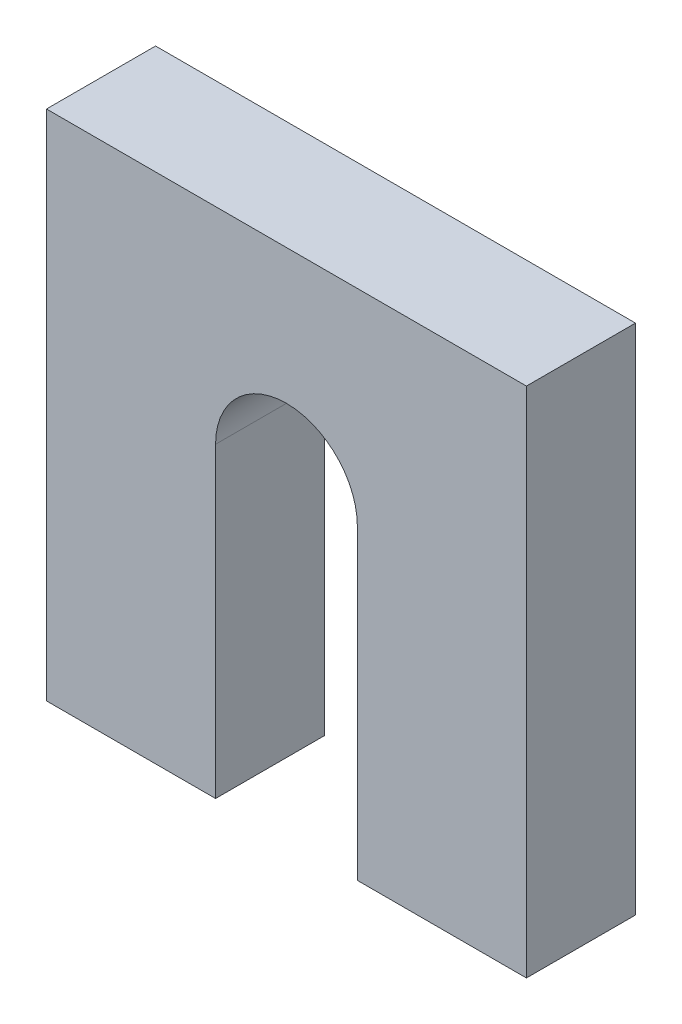
ISO-10303-21;
HEADER;
FILE_DESCRIPTION(('STEP AP214'),'2;1');
FILE_NAME('part.step','',(''),(''),'','','');
FILE_SCHEMA(('AUTOMOTIVE_DESIGN { 1 0 10303 214 1 1 1 1 }'));
ENDSEC;
DATA;
#1=APPLICATION_CONTEXT('core data for automotive mechanical design processes');
#2=APPLICATION_PROTOCOL_DEFINITION('international standard','automotive_design',2000,#1);
#3=PRODUCT_CONTEXT('',#1,'mechanical');
#4=PRODUCT('Part','Part','',(#3));
#5=PRODUCT_RELATED_PRODUCT_CATEGORY('part','',(#4));
#6=PRODUCT_DEFINITION_FORMATION('','',#4);
#7=PRODUCT_DEFINITION_CONTEXT('part definition',#1,'design');
#8=PRODUCT_DEFINITION('design','',#6,#7);
#9=PRODUCT_DEFINITION_SHAPE('','',#8);
#10=(LENGTH_UNIT() NAMED_UNIT(*) SI_UNIT(.MILLI.,.METRE.));
#11=(NAMED_UNIT(*) PLANE_ANGLE_UNIT() SI_UNIT($,.RADIAN.));
#12=(NAMED_UNIT(*) SI_UNIT($,.STERADIAN.) SOLID_ANGLE_UNIT());
#13=UNCERTAINTY_MEASURE_WITH_UNIT(LENGTH_MEASURE(1.E-05),#10,'distance_accuracy_value','');
#14=(GEOMETRIC_REPRESENTATION_CONTEXT(3) GLOBAL_UNCERTAINTY_ASSIGNED_CONTEXT((#13)) GLOBAL_UNIT_ASSIGNED_CONTEXT((#10,
#11,#12)) REPRESENTATION_CONTEXT('',''));
#15=CARTESIAN_POINT('',(0.,0.,0.));
#16=DIRECTION('',(0.,0.,1.));
#17=DIRECTION('',(1.,0.,0.));
#18=AXIS2_PLACEMENT_3D('',#15,#16,#17);
#19=CARTESIAN_POINT('',(22.,-23.5,10.));
#20=DIRECTION('',(0.,1.,0.));
#21=DIRECTION('',(-1.,0.,0.));
#22=AXIS2_PLACEMENT_3D('',#19,#20,#21);
#23=PLANE('',#22);
#24=DIRECTION('',(1.,0.,0.));
#25=VECTOR('',#24,1.);
#26=CARTESIAN_POINT('',(22.,-23.5,0.));
#27=LINE('',#26,#25);
#28=CARTESIAN_POINT('',(-22.,-23.5,0.));
#29=VERTEX_POINT('',#28);
#30=CARTESIAN_POINT('',(-6.5,-23.5,0.));
#31=VERTEX_POINT('',#30);
#32=EDGE_CURVE('E145',#29,#31,#27,.T.);
#33=ORIENTED_EDGE('',*,*,#32,.T.);
#34=DIRECTION('',(0.,0.,1.));
#35=VECTOR('',#34,1.);
#36=CARTESIAN_POINT('',(-6.5,-23.5,0.));
#37=LINE('',#36,#35);
#38=CARTESIAN_POINT('',(-6.5,-23.5,10.));
#39=VERTEX_POINT('',#38);
#40=EDGE_CURVE('E152',#31,#39,#37,.T.);
#41=ORIENTED_EDGE('',*,*,#40,.T.);
#42=DIRECTION('',(1.,0.,0.));
#43=VECTOR('',#42,1.);
#44=CARTESIAN_POINT('',(22.,-23.5,10.));
#45=LINE('',#44,#43);
#46=CARTESIAN_POINT('',(-22.,-23.5,10.));
#47=VERTEX_POINT('',#46);
#48=EDGE_CURVE('E96',#47,#39,#45,.T.);
#49=ORIENTED_EDGE('',*,*,#48,.F.);
#50=DIRECTION('',(0.,0.,-1.));
#51=VECTOR('',#50,1.);
#52=CARTESIAN_POINT('',(-22.,-23.5,10.));
#53=LINE('',#52,#51);
#54=EDGE_CURVE('E11',#47,#29,#53,.T.);
#55=ORIENTED_EDGE('',*,*,#54,.T.);
#56=EDGE_LOOP('',(#33,#41,#49,#55));
#57=FACE_BOUND('',#56,.T.);
#58=ADVANCED_FACE('F43',(#57),#23,.F.);
#59=CARTESIAN_POINT('',(-22.,23.5,10.));
#60=DIRECTION('',(1.,0.,0.));
#61=DIRECTION('',(0.,1.,0.));
#62=AXIS2_PLACEMENT_3D('',#59,#60,#61);
#63=PLANE('',#62);
#64=DIRECTION('',(0.,-1.,0.));
#65=VECTOR('',#64,1.);
#66=CARTESIAN_POINT('',(-22.,23.5,0.));
#67=LINE('',#66,#65);
#68=CARTESIAN_POINT('',(-22.,23.5,0.));
#69=VERTEX_POINT('',#68);
#70=EDGE_CURVE('E146',#69,#29,#67,.T.);
#71=ORIENTED_EDGE('',*,*,#70,.T.);
#72=ORIENTED_EDGE('',*,*,#54,.F.);
#73=DIRECTION('',(0.,-1.,0.));
#74=VECTOR('',#73,1.);
#75=CARTESIAN_POINT('',(-22.,23.5,10.));
#76=LINE('',#75,#74);
#77=CARTESIAN_POINT('',(-22.,23.5,10.));
#78=VERTEX_POINT('',#77);
#79=EDGE_CURVE('E160',#78,#47,#76,.T.);
#80=ORIENTED_EDGE('',*,*,#79,.F.);
#81=DIRECTION('',(0.,0.,-1.));
#82=VECTOR('',#81,1.);
#83=CARTESIAN_POINT('',(-22.,23.5,10.));
#84=LINE('',#83,#82);
#85=EDGE_CURVE('E161',#78,#69,#84,.T.);
#86=ORIENTED_EDGE('',*,*,#85,.T.);
#87=EDGE_LOOP('',(#71,#72,#80,#86));
#88=FACE_BOUND('',#87,.T.);
#89=ADVANCED_FACE('F45',(#88),#63,.F.);
#90=CARTESIAN_POINT('',(6.5,-23.5,10.));
#91=VERTEX_POINT('',#90);
#92=CARTESIAN_POINT('',(22.,-23.5,10.));
#93=VERTEX_POINT('',#92);
#94=EDGE_CURVE('E136',#91,#93,#45,.T.);
#95=ORIENTED_EDGE('',*,*,#94,.F.);
#96=DIRECTION('',(0.,0.,1.));
#97=VECTOR('',#96,1.);
#98=CARTESIAN_POINT('',(6.5,-23.5,0.));
#99=LINE('',#98,#97);
#100=CARTESIAN_POINT('',(6.5,-23.5,0.));
#101=VERTEX_POINT('',#100);
#102=EDGE_CURVE('E122',#101,#91,#99,.T.);
#103=ORIENTED_EDGE('',*,*,#102,.F.);
#104=CARTESIAN_POINT('',(22.,-23.5,0.));
#105=VERTEX_POINT('',#104);
#106=EDGE_CURVE('E134',#101,#105,#27,.T.);
#107=ORIENTED_EDGE('',*,*,#106,.T.);
#108=DIRECTION('',(0.,0.,-1.));
#109=VECTOR('',#108,1.);
#110=CARTESIAN_POINT('',(22.,-23.5,10.));
#111=LINE('',#110,#109);
#112=EDGE_CURVE('E52',#93,#105,#111,.T.);
#113=ORIENTED_EDGE('',*,*,#112,.F.);
#114=EDGE_LOOP('',(#95,#103,#107,#113));
#115=FACE_BOUND('',#114,.T.);
#116=ADVANCED_FACE('F132',(#115),#23,.F.);
#117=CARTESIAN_POINT('',(22.,23.5,10.));
#118=DIRECTION('',(-1.,0.,0.));
#119=DIRECTION('',(0.,-1.,0.));
#120=AXIS2_PLACEMENT_3D('',#117,#118,#119);
#121=PLANE('',#120);
#122=DIRECTION('',(0.,1.,0.));
#123=VECTOR('',#122,1.);
#124=CARTESIAN_POINT('',(22.,23.5,0.));
#125=LINE('',#124,#123);
#126=CARTESIAN_POINT('',(22.,23.5,0.));
#127=VERTEX_POINT('',#126);
#128=EDGE_CURVE('E143',#105,#127,#125,.T.);
#129=ORIENTED_EDGE('',*,*,#128,.T.);
#130=DIRECTION('',(0.,0.,-1.));
#131=VECTOR('',#130,1.);
#132=CARTESIAN_POINT('',(22.,23.5,10.));
#133=LINE('',#132,#131);
#134=CARTESIAN_POINT('',(22.,23.5,10.));
#135=VERTEX_POINT('',#134);
#136=EDGE_CURVE('E164',#135,#127,#133,.T.);
#137=ORIENTED_EDGE('',*,*,#136,.F.);
#138=DIRECTION('',(0.,1.,0.));
#139=VECTOR('',#138,1.);
#140=CARTESIAN_POINT('',(22.,23.5,10.));
#141=LINE('',#140,#139);
#142=EDGE_CURVE('E171',#93,#135,#141,.T.);
#143=ORIENTED_EDGE('',*,*,#142,.F.);
#144=ORIENTED_EDGE('',*,*,#112,.T.);
#145=EDGE_LOOP('',(#129,#137,#143,#144));
#146=FACE_BOUND('',#145,.T.);
#147=ADVANCED_FACE('F169',(#146),#121,.F.);
#148=CARTESIAN_POINT('',(22.,23.5,10.));
#149=DIRECTION('',(0.,-1.,0.));
#150=DIRECTION('',(1.,0.,0.));
#151=AXIS2_PLACEMENT_3D('',#148,#149,#150);
#152=PLANE('',#151);
#153=DIRECTION('',(-1.,0.,0.));
#154=VECTOR('',#153,1.);
#155=CARTESIAN_POINT('',(22.,23.5,0.));
#156=LINE('',#155,#154);
#157=EDGE_CURVE('E89',#127,#69,#156,.T.);
#158=ORIENTED_EDGE('',*,*,#157,.T.);
#159=ORIENTED_EDGE('',*,*,#85,.F.);
#160=DIRECTION('',(-1.,0.,0.));
#161=VECTOR('',#160,1.);
#162=CARTESIAN_POINT('',(22.,23.5,10.));
#163=LINE('',#162,#161);
#164=EDGE_CURVE('E68',#135,#78,#163,.T.);
#165=ORIENTED_EDGE('',*,*,#164,.F.);
#166=ORIENTED_EDGE('',*,*,#136,.T.);
#167=EDGE_LOOP('',(#158,#159,#165,#166));
#168=FACE_BOUND('',#167,.T.);
#169=ADVANCED_FACE('F205',(#168),#152,.F.);
#170=CARTESIAN_POINT('',(0.,0.,10.));
#171=DIRECTION('',(0.,0.,-1.));
#172=DIRECTION('',(-1.,0.,0.));
#173=AXIS2_PLACEMENT_3D('',#170,#171,#172);
#174=PLANE('',#173);
#175=ORIENTED_EDGE('',*,*,#48,.T.);
#176=DIRECTION('',(0.,-1.,0.));
#177=VECTOR('',#176,1.);
#178=CARTESIAN_POINT('',(-6.5,-23.5,10.));
#179=LINE('',#178,#177);
#180=CARTESIAN_POINT('',(-6.5,4.62828051725641,10.));
#181=VERTEX_POINT('',#180);
#182=EDGE_CURVE('E128',#181,#39,#179,.T.);
#183=ORIENTED_EDGE('',*,*,#182,.F.);
#184=CARTESIAN_POINT('',(0.,4.62828051725641,10.));
#185=DIRECTION('',(0.,0.,1.));
#186=DIRECTION('',(1.,0.,0.));
#187=AXIS2_PLACEMENT_3D('',#184,#185,#186);
#188=CIRCLE('',#187,6.5);
#189=CARTESIAN_POINT('',(6.5,4.62828051725641,10.));
#190=VERTEX_POINT('',#189);
#191=EDGE_CURVE('E189',#190,#181,#188,.T.);
#192=ORIENTED_EDGE('',*,*,#191,.F.);
#193=DIRECTION('',(0.,1.,0.));
#194=VECTOR('',#193,1.);
#195=CARTESIAN_POINT('',(6.5,-23.5,10.));
#196=LINE('',#195,#194);
#197=EDGE_CURVE('E193',#91,#190,#196,.T.);
#198=ORIENTED_EDGE('',*,*,#197,.F.);
#199=ORIENTED_EDGE('',*,*,#94,.T.);
#200=ORIENTED_EDGE('',*,*,#142,.T.);
#201=ORIENTED_EDGE('',*,*,#164,.T.);
#202=ORIENTED_EDGE('',*,*,#79,.T.);
#203=EDGE_LOOP('',(#175,#183,#192,#198,#199,#200,#201,#202));
#204=FACE_BOUND('',#203,.T.);
#205=ADVANCED_FACE('F207',(#204),#174,.F.);
#206=CARTESIAN_POINT('',(0.,0.,0.));
#207=DIRECTION('',(0.,0.,-1.));
#208=DIRECTION('',(-1.,0.,0.));
#209=AXIS2_PLACEMENT_3D('',#206,#207,#208);
#210=PLANE('',#209);
#211=DIRECTION('',(0.,-1.,0.));
#212=VECTOR('',#211,1.);
#213=CARTESIAN_POINT('',(-6.5,-23.5,0.));
#214=LINE('',#213,#212);
#215=CARTESIAN_POINT('',(-6.5,4.62828051725641,0.));
#216=VERTEX_POINT('',#215);
#217=EDGE_CURVE('E138',#216,#31,#214,.T.);
#218=ORIENTED_EDGE('',*,*,#217,.T.);
#219=ORIENTED_EDGE('',*,*,#32,.F.);
#220=ORIENTED_EDGE('',*,*,#70,.F.);
#221=ORIENTED_EDGE('',*,*,#157,.F.);
#222=ORIENTED_EDGE('',*,*,#128,.F.);
#223=ORIENTED_EDGE('',*,*,#106,.F.);
#224=DIRECTION('',(0.,1.,0.));
#225=VECTOR('',#224,1.);
#226=CARTESIAN_POINT('',(6.5,-23.5,0.));
#227=LINE('',#226,#225);
#228=CARTESIAN_POINT('',(6.5,4.62828051725641,0.));
#229=VERTEX_POINT('',#228);
#230=EDGE_CURVE('E118',#101,#229,#227,.T.);
#231=ORIENTED_EDGE('',*,*,#230,.T.);
#232=CARTESIAN_POINT('',(0.,4.62828051725641,0.));
#233=DIRECTION('',(0.,0.,1.));
#234=DIRECTION('',(1.,0.,0.));
#235=AXIS2_PLACEMENT_3D('',#232,#233,#234);
#236=CIRCLE('',#235,6.5);
#237=EDGE_CURVE('E59',#229,#216,#236,.T.);
#238=ORIENTED_EDGE('',*,*,#237,.T.);
#239=EDGE_LOOP('',(#218,#219,#220,#221,#222,#223,#231,#238));
#240=FACE_BOUND('',#239,.T.);
#241=ADVANCED_FACE('F142',(#240),#210,.T.);
#242=CARTESIAN_POINT('',(-6.5,-23.5,0.));
#243=DIRECTION('',(-1.,0.,0.));
#244=DIRECTION('',(0.,0.,1.));
#245=AXIS2_PLACEMENT_3D('',#242,#243,#244);
#246=PLANE('',#245);
#247=ORIENTED_EDGE('',*,*,#182,.T.);
#248=ORIENTED_EDGE('',*,*,#40,.F.);
#249=ORIENTED_EDGE('',*,*,#217,.F.);
#250=DIRECTION('',(0.,0.,1.));
#251=VECTOR('',#250,1.);
#252=CARTESIAN_POINT('',(-6.5,4.62828051725641,0.));
#253=LINE('',#252,#251);
#254=EDGE_CURVE('E182',#216,#181,#253,.T.);
#255=ORIENTED_EDGE('',*,*,#254,.T.);
#256=EDGE_LOOP('',(#247,#248,#249,#255));
#257=FACE_BOUND('',#256,.T.);
#258=ADVANCED_FACE('F255',(#257),#246,.F.);
#259=CARTESIAN_POINT('',(0.,4.62828051725641,0.));
#260=DIRECTION('',(0.,0.,1.));
#261=DIRECTION('',(1.,0.,0.));
#262=AXIS2_PLACEMENT_3D('',#259,#260,#261);
#263=CYLINDRICAL_SURFACE('',#262,6.5);
#264=ORIENTED_EDGE('',*,*,#191,.T.);
#265=ORIENTED_EDGE('',*,*,#254,.F.);
#266=ORIENTED_EDGE('',*,*,#237,.F.);
#267=DIRECTION('',(0.,0.,1.));
#268=VECTOR('',#267,1.);
#269=CARTESIAN_POINT('',(6.5,4.62828051725641,0.));
#270=LINE('',#269,#268);
#271=EDGE_CURVE('E124',#229,#190,#270,.T.);
#272=ORIENTED_EDGE('',*,*,#271,.T.);
#273=EDGE_LOOP('',(#264,#265,#266,#272));
#274=FACE_BOUND('',#273,.T.);
#275=ADVANCED_FACE('F259',(#274),#263,.F.);
#276=CARTESIAN_POINT('',(6.5,-23.5,0.));
#277=DIRECTION('',(1.,0.,0.));
#278=DIRECTION('',(0.,0.,-1.));
#279=AXIS2_PLACEMENT_3D('',#276,#277,#278);
#280=PLANE('',#279);
#281=ORIENTED_EDGE('',*,*,#197,.T.);
#282=ORIENTED_EDGE('',*,*,#271,.F.);
#283=ORIENTED_EDGE('',*,*,#230,.F.);
#284=ORIENTED_EDGE('',*,*,#102,.T.);
#285=EDGE_LOOP('',(#281,#282,#283,#284));
#286=FACE_BOUND('',#285,.T.);
#287=ADVANCED_FACE('F121',(#286),#280,.F.);
#288=CLOSED_SHELL('',(#58,#89,#116,#147,#169,#205,#241,#258,#275,#287));
#289=MANIFOLD_SOLID_BREP('B2',#288);
#290=ADVANCED_BREP_SHAPE_REPRESENTATION('',(#18,#289),#14);
#291=SHAPE_DEFINITION_REPRESENTATION(#9,#290);
ENDSEC;
END-ISO-10303-21;
